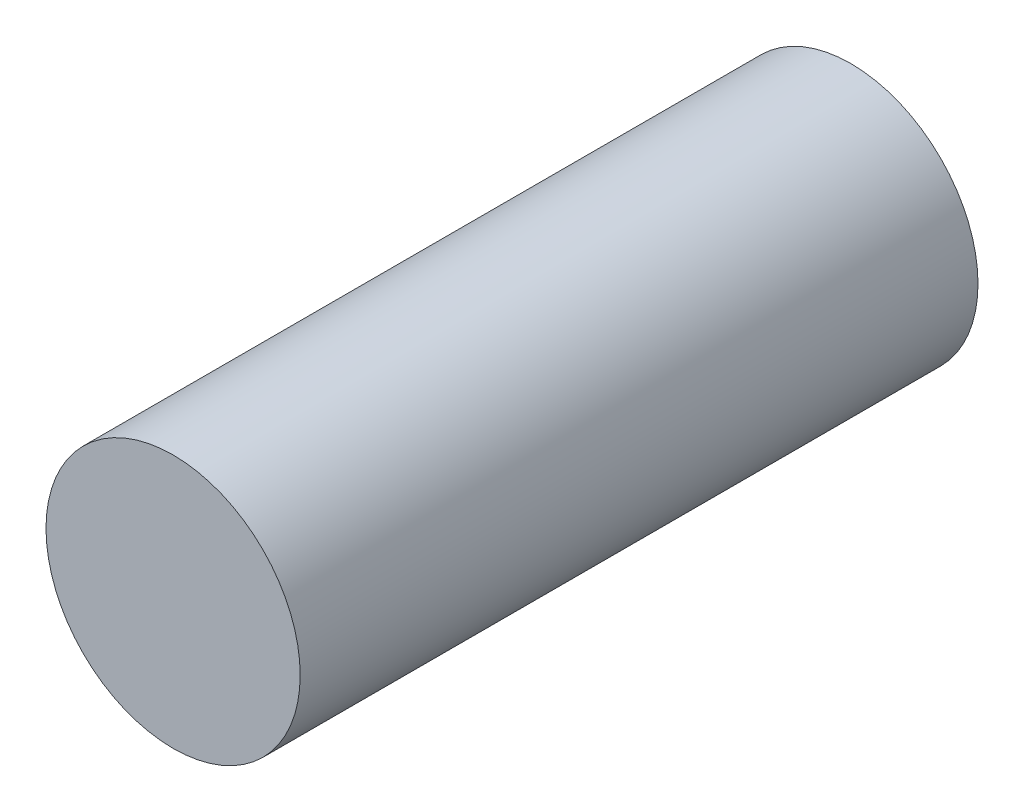
ISO-10303-21;
HEADER;
FILE_DESCRIPTION(('STEP AP214'),'2;1');
FILE_NAME('part.step','',(''),(''),'','','');
FILE_SCHEMA(('AUTOMOTIVE_DESIGN { 1 0 10303 214 1 1 1 1 }'));
ENDSEC;
DATA;
#1=APPLICATION_CONTEXT('core data for automotive mechanical design processes');
#2=APPLICATION_PROTOCOL_DEFINITION('international standard','automotive_design',2000,#1);
#3=PRODUCT_CONTEXT('',#1,'mechanical');
#4=PRODUCT('Part','Part','',(#3));
#5=PRODUCT_RELATED_PRODUCT_CATEGORY('part','',(#4));
#6=PRODUCT_DEFINITION_FORMATION('','',#4);
#7=PRODUCT_DEFINITION_CONTEXT('part definition',#1,'design');
#8=PRODUCT_DEFINITION('design','',#6,#7);
#9=PRODUCT_DEFINITION_SHAPE('','',#8);
#10=(LENGTH_UNIT() NAMED_UNIT(*) SI_UNIT(.MILLI.,.METRE.));
#11=(NAMED_UNIT(*) PLANE_ANGLE_UNIT() SI_UNIT($,.RADIAN.));
#12=(NAMED_UNIT(*) SI_UNIT($,.STERADIAN.) SOLID_ANGLE_UNIT());
#13=UNCERTAINTY_MEASURE_WITH_UNIT(LENGTH_MEASURE(1.E-05),#10,'distance_accuracy_value','');
#14=(GEOMETRIC_REPRESENTATION_CONTEXT(3) GLOBAL_UNCERTAINTY_ASSIGNED_CONTEXT((#13)) GLOBAL_UNIT_ASSIGNED_CONTEXT((#10,
#11,#12)) REPRESENTATION_CONTEXT('',''));
#15=CARTESIAN_POINT('',(0.,0.,0.));
#16=DIRECTION('',(0.,0.,1.));
#17=DIRECTION('',(1.,0.,0.));
#18=AXIS2_PLACEMENT_3D('',#15,#16,#17);
#19=CARTESIAN_POINT('',(53.9335978323588,-36.2790163160108,-10.));
#20=DIRECTION('',(0.,0.,1.));
#21=DIRECTION('',(1.,0.,0.));
#22=AXIS2_PLACEMENT_3D('',#19,#20,#21);
#23=CYLINDRICAL_SURFACE('',#22,3.75);
#24=CARTESIAN_POINT('',(53.9335978323588,-36.2790163160108,-10.));
#25=DIRECTION('',(0.,0.,1.));
#26=DIRECTION('',(1.,0.,0.));
#27=AXIS2_PLACEMENT_3D('',#24,#25,#26);
#28=CIRCLE('',#27,3.75);
#29=CARTESIAN_POINT('',(57.6835978323588,-36.2790163160108,-10.));
#30=VERTEX_POINT('',#29);
#31=EDGE_CURVE('E41',#30,#30,#28,.T.);
#32=ORIENTED_EDGE('',*,*,#31,.T.);
#33=EDGE_LOOP('',(#32));
#34=FACE_BOUND('',#33,.T.);
#35=CARTESIAN_POINT('',(53.9335978323588,-36.2790163160108,10.));
#36=DIRECTION('',(0.,0.,1.));
#37=DIRECTION('',(1.,0.,0.));
#38=AXIS2_PLACEMENT_3D('',#35,#36,#37);
#39=CIRCLE('',#38,3.75);
#40=CARTESIAN_POINT('',(57.6835978323588,-36.2790163160108,10.));
#41=VERTEX_POINT('',#40);
#42=EDGE_CURVE('E10',#41,#41,#39,.T.);
#43=ORIENTED_EDGE('',*,*,#42,.F.);
#44=EDGE_LOOP('',(#43));
#45=FACE_BOUND('',#44,.T.);
#46=ADVANCED_FACE('F34',(#34,#45),#23,.T.);
#47=CARTESIAN_POINT('',(53.9335978323588,-36.2790163160108,-10.));
#48=DIRECTION('',(0.,0.,1.));
#49=DIRECTION('',(1.,0.,0.));
#50=AXIS2_PLACEMENT_3D('',#47,#48,#49);
#51=PLANE('',#50);
#52=ORIENTED_EDGE('',*,*,#31,.F.);
#53=EDGE_LOOP('',(#52));
#54=FACE_BOUND('',#53,.T.);
#55=ADVANCED_FACE('F49',(#54),#51,.F.);
#56=CARTESIAN_POINT('',(53.9335978323588,-36.2790163160108,10.));
#57=DIRECTION('',(0.,0.,1.));
#58=DIRECTION('',(1.,0.,0.));
#59=AXIS2_PLACEMENT_3D('',#56,#57,#58);
#60=PLANE('',#59);
#61=ORIENTED_EDGE('',*,*,#42,.T.);
#62=EDGE_LOOP('',(#61));
#63=FACE_BOUND('',#62,.T.);
#64=ADVANCED_FACE('F36',(#63),#60,.T.);
#65=CLOSED_SHELL('',(#46,#55,#64));
#66=MANIFOLD_SOLID_BREP('B2',#65);
#67=ADVANCED_BREP_SHAPE_REPRESENTATION('',(#18,#66),#14);
#68=SHAPE_DEFINITION_REPRESENTATION(#9,#67);
ENDSEC;
END-ISO-10303-21;
